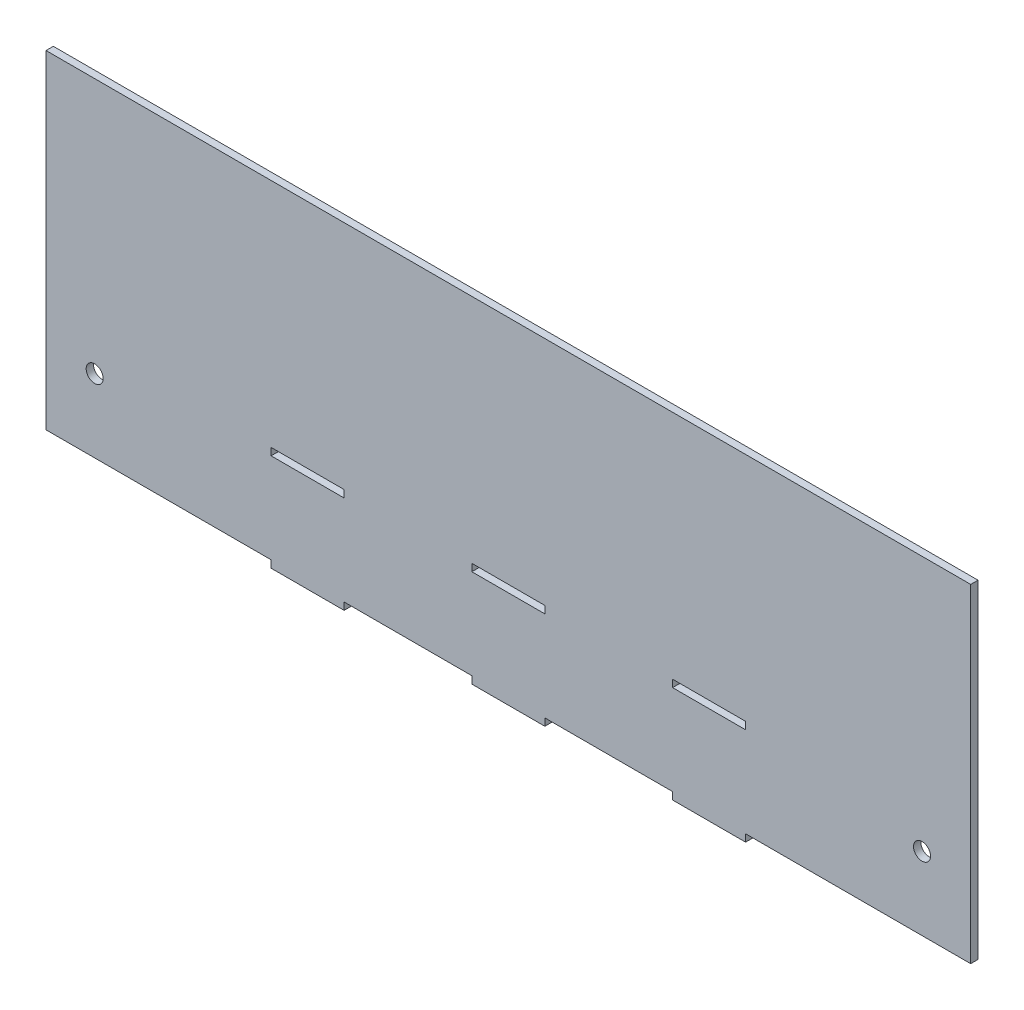
ISO-10303-21;
HEADER;
FILE_DESCRIPTION(('STEP AP214'),'2;1');
FILE_NAME('part.step','',(''),(''),'','','');
FILE_SCHEMA(('AUTOMOTIVE_DESIGN { 1 0 10303 214 1 1 1 1 }'));
ENDSEC;
DATA;
#1=APPLICATION_CONTEXT('core data for automotive mechanical design processes');
#2=APPLICATION_PROTOCOL_DEFINITION('international standard','automotive_design',2000,#1);
#3=PRODUCT_CONTEXT('',#1,'mechanical');
#4=PRODUCT('Part','Part','',(#3));
#5=PRODUCT_RELATED_PRODUCT_CATEGORY('part','',(#4));
#6=PRODUCT_DEFINITION_FORMATION('','',#4);
#7=PRODUCT_DEFINITION_CONTEXT('part definition',#1,'design');
#8=PRODUCT_DEFINITION('design','',#6,#7);
#9=PRODUCT_DEFINITION_SHAPE('','',#8);
#10=(LENGTH_UNIT() NAMED_UNIT(*) SI_UNIT(.MILLI.,.METRE.));
#11=(NAMED_UNIT(*) PLANE_ANGLE_UNIT() SI_UNIT($,.RADIAN.));
#12=(NAMED_UNIT(*) SI_UNIT($,.STERADIAN.) SOLID_ANGLE_UNIT());
#13=UNCERTAINTY_MEASURE_WITH_UNIT(LENGTH_MEASURE(1.E-05),#10,'distance_accuracy_value','');
#14=(GEOMETRIC_REPRESENTATION_CONTEXT(3) GLOBAL_UNCERTAINTY_ASSIGNED_CONTEXT((#13)) GLOBAL_UNIT_ASSIGNED_CONTEXT((#10,
#11,#12)) REPRESENTATION_CONTEXT('',''));
#15=CARTESIAN_POINT('',(0.,0.,0.));
#16=DIRECTION('',(0.,0.,1.));
#17=DIRECTION('',(1.,0.,0.));
#18=AXIS2_PLACEMENT_3D('',#15,#16,#17);
#19=CARTESIAN_POINT('',(0.,0.,3.));
#20=DIRECTION('',(0.,0.,-1.));
#21=DIRECTION('',(-1.,0.,0.));
#22=AXIS2_PLACEMENT_3D('',#19,#20,#21);
#23=PLANE('',#22);
#24=DIRECTION('',(0.,1.,0.));
#25=VECTOR('',#24,1.);
#26=CARTESIAN_POINT('',(97.5,-30.5,3.));
#27=LINE('',#26,#25);
#28=CARTESIAN_POINT('',(97.5,-30.5,3.));
#29=VERTEX_POINT('',#28);
#30=CARTESIAN_POINT('',(97.5,-27.5,3.));
#31=VERTEX_POINT('',#30);
#32=EDGE_CURVE('E278',#29,#31,#27,.T.);
#33=ORIENTED_EDGE('',*,*,#32,.F.);
#34=DIRECTION('',(1.,0.,0.));
#35=VECTOR('',#34,1.);
#36=CARTESIAN_POINT('',(67.5,-30.5,3.));
#37=LINE('',#36,#35);
#38=CARTESIAN_POINT('',(67.5,-30.5,3.));
#39=VERTEX_POINT('',#38);
#40=EDGE_CURVE('E289',#39,#29,#37,.T.);
#41=ORIENTED_EDGE('',*,*,#40,.F.);
#42=DIRECTION('',(0.,-1.,0.));
#43=VECTOR('',#42,1.);
#44=CARTESIAN_POINT('',(67.5,-30.5,3.));
#45=LINE('',#44,#43);
#46=CARTESIAN_POINT('',(67.5,-27.5,3.));
#47=VERTEX_POINT('',#46);
#48=EDGE_CURVE('E285',#47,#39,#45,.T.);
#49=ORIENTED_EDGE('',*,*,#48,.F.);
#50=DIRECTION('',(-1.,0.,0.));
#51=VECTOR('',#50,1.);
#52=CARTESIAN_POINT('',(67.5,-27.5,3.));
#53=LINE('',#52,#51);
#54=EDGE_CURVE('E281',#31,#47,#53,.T.);
#55=ORIENTED_EDGE('',*,*,#54,.F.);
#56=EDGE_LOOP('',(#33,#41,#49,#55));
#57=FACE_BOUND('',#56,.T.);
#58=DIRECTION('',(0.,1.,0.));
#59=VECTOR('',#58,1.);
#60=CARTESIAN_POINT('',(190.,-67.5,3.));
#61=LINE('',#60,#59);
#62=CARTESIAN_POINT('',(190.,-67.5,3.));
#63=VERTEX_POINT('',#62);
#64=CARTESIAN_POINT('',(190.,67.5,3.));
#65=VERTEX_POINT('',#64);
#66=EDGE_CURVE('E364',#63,#65,#61,.T.);
#67=ORIENTED_EDGE('',*,*,#66,.T.);
#68=DIRECTION('',(-1.,0.,0.));
#69=VECTOR('',#68,1.);
#70=CARTESIAN_POINT('',(-190.,67.5,3.));
#71=LINE('',#70,#69);
#72=CARTESIAN_POINT('',(-190.,67.5,3.));
#73=VERTEX_POINT('',#72);
#74=EDGE_CURVE('E368',#65,#73,#71,.T.);
#75=ORIENTED_EDGE('',*,*,#74,.T.);
#76=DIRECTION('',(0.,-1.,0.));
#77=VECTOR('',#76,1.);
#78=CARTESIAN_POINT('',(-190.,-67.5,3.));
#79=LINE('',#78,#77);
#80=CARTESIAN_POINT('',(-190.,-67.5,3.));
#81=VERTEX_POINT('',#80);
#82=EDGE_CURVE('E372',#73,#81,#79,.T.);
#83=ORIENTED_EDGE('',*,*,#82,.T.);
#84=DIRECTION('',(1.,0.,0.));
#85=VECTOR('',#84,1.);
#86=CARTESIAN_POINT('',(-190.,-67.5,3.));
#87=LINE('',#86,#85);
#88=CARTESIAN_POINT('',(-97.5,-67.5,3.));
#89=VERTEX_POINT('',#88);
#90=EDGE_CURVE('E375',#81,#89,#87,.T.);
#91=ORIENTED_EDGE('',*,*,#90,.T.);
#92=DIRECTION('',(0.,-1.,0.));
#93=VECTOR('',#92,1.);
#94=CARTESIAN_POINT('',(-97.5,-70.5,3.));
#95=LINE('',#94,#93);
#96=CARTESIAN_POINT('',(-97.5,-70.5,3.));
#97=VERTEX_POINT('',#96);
#98=EDGE_CURVE('E378',#89,#97,#95,.T.);
#99=ORIENTED_EDGE('',*,*,#98,.T.);
#100=DIRECTION('',(1.,0.,0.));
#101=VECTOR('',#100,1.);
#102=CARTESIAN_POINT('',(-97.5,-70.5,3.));
#103=LINE('',#102,#101);
#104=CARTESIAN_POINT('',(-67.5,-70.5,3.));
#105=VERTEX_POINT('',#104);
#106=EDGE_CURVE('E381',#97,#105,#103,.T.);
#107=ORIENTED_EDGE('',*,*,#106,.T.);
#108=DIRECTION('',(0.,1.,0.));
#109=VECTOR('',#108,1.);
#110=CARTESIAN_POINT('',(-67.5,-70.5,3.));
#111=LINE('',#110,#109);
#112=CARTESIAN_POINT('',(-67.5,-67.5,3.));
#113=VERTEX_POINT('',#112);
#114=EDGE_CURVE('E384',#105,#113,#111,.T.);
#115=ORIENTED_EDGE('',*,*,#114,.T.);
#116=DIRECTION('',(1.,0.,0.));
#117=VECTOR('',#116,1.);
#118=CARTESIAN_POINT('',(-67.5,-67.5,3.));
#119=LINE('',#118,#117);
#120=CARTESIAN_POINT('',(-14.9999999999999,-67.5,3.));
#121=VERTEX_POINT('',#120);
#122=EDGE_CURVE('E387',#113,#121,#119,.T.);
#123=ORIENTED_EDGE('',*,*,#122,.T.);
#124=DIRECTION('',(0.,-1.,0.));
#125=VECTOR('',#124,1.);
#126=CARTESIAN_POINT('',(-14.9999999999999,-70.5,3.));
#127=LINE('',#126,#125);
#128=CARTESIAN_POINT('',(-14.9999999999999,-70.5,3.));
#129=VERTEX_POINT('',#128);
#130=EDGE_CURVE('E390',#121,#129,#127,.T.);
#131=ORIENTED_EDGE('',*,*,#130,.T.);
#132=DIRECTION('',(1.,0.,0.));
#133=VECTOR('',#132,1.);
#134=CARTESIAN_POINT('',(-14.9999999999999,-70.5,3.));
#135=LINE('',#134,#133);
#136=CARTESIAN_POINT('',(15.0000000000001,-70.5,3.));
#137=VERTEX_POINT('',#136);
#138=EDGE_CURVE('E393',#129,#137,#135,.T.);
#139=ORIENTED_EDGE('',*,*,#138,.T.);
#140=DIRECTION('',(0.,1.,0.));
#141=VECTOR('',#140,1.);
#142=CARTESIAN_POINT('',(15.0000000000001,-70.5,3.));
#143=LINE('',#142,#141);
#144=CARTESIAN_POINT('',(15.0000000000001,-67.5,3.));
#145=VERTEX_POINT('',#144);
#146=EDGE_CURVE('E396',#137,#145,#143,.T.);
#147=ORIENTED_EDGE('',*,*,#146,.T.);
#148=DIRECTION('',(1.,0.,0.));
#149=VECTOR('',#148,1.);
#150=CARTESIAN_POINT('',(15.0000000000001,-67.5,3.));
#151=LINE('',#150,#149);
#152=CARTESIAN_POINT('',(67.5,-67.5,3.));
#153=VERTEX_POINT('',#152);
#154=EDGE_CURVE('E399',#145,#153,#151,.T.);
#155=ORIENTED_EDGE('',*,*,#154,.T.);
#156=DIRECTION('',(0.,-1.,0.));
#157=VECTOR('',#156,1.);
#158=CARTESIAN_POINT('',(67.5,-70.5,3.));
#159=LINE('',#158,#157);
#160=CARTESIAN_POINT('',(67.5,-70.5,3.));
#161=VERTEX_POINT('',#160);
#162=EDGE_CURVE('E402',#153,#161,#159,.T.);
#163=ORIENTED_EDGE('',*,*,#162,.T.);
#164=DIRECTION('',(1.,0.,0.));
#165=VECTOR('',#164,1.);
#166=CARTESIAN_POINT('',(67.5,-70.5,3.));
#167=LINE('',#166,#165);
#168=CARTESIAN_POINT('',(97.5,-70.5,3.));
#169=VERTEX_POINT('',#168);
#170=EDGE_CURVE('E405',#161,#169,#167,.T.);
#171=ORIENTED_EDGE('',*,*,#170,.T.);
#172=DIRECTION('',(0.,1.,0.));
#173=VECTOR('',#172,1.);
#174=CARTESIAN_POINT('',(97.5,-70.5,3.));
#175=LINE('',#174,#173);
#176=CARTESIAN_POINT('',(97.5,-67.5,3.));
#177=VERTEX_POINT('',#176);
#178=EDGE_CURVE('E408',#169,#177,#175,.T.);
#179=ORIENTED_EDGE('',*,*,#178,.T.);
#180=DIRECTION('',(1.,0.,0.));
#181=VECTOR('',#180,1.);
#182=CARTESIAN_POINT('',(97.5,-67.5,3.));
#183=LINE('',#182,#181);
#184=EDGE_CURVE('E411',#177,#63,#183,.T.);
#185=ORIENTED_EDGE('',*,*,#184,.T.);
#186=EDGE_LOOP('',(#67,#75,#83,#91,#99,#107,#115,#123,#131,#139,#147,#155,#163,#171,#179,#185));
#187=FACE_BOUND('',#186,.T.);
#188=DIRECTION('',(0.,1.,0.));
#189=VECTOR('',#188,1.);
#190=CARTESIAN_POINT('',(15.,-30.5,3.));
#191=LINE('',#190,#189);
#192=CARTESIAN_POINT('',(15.,-30.5,3.));
#193=VERTEX_POINT('',#192);
#194=CARTESIAN_POINT('',(15.,-27.5,3.));
#195=VERTEX_POINT('',#194);
#196=EDGE_CURVE('E321',#193,#195,#191,.T.);
#197=ORIENTED_EDGE('',*,*,#196,.F.);
#198=DIRECTION('',(1.,0.,0.));
#199=VECTOR('',#198,1.);
#200=CARTESIAN_POINT('',(-15.,-30.5,3.));
#201=LINE('',#200,#199);
#202=CARTESIAN_POINT('',(-15.,-30.5,3.));
#203=VERTEX_POINT('',#202);
#204=EDGE_CURVE('E332',#203,#193,#201,.T.);
#205=ORIENTED_EDGE('',*,*,#204,.F.);
#206=DIRECTION('',(0.,-1.,0.));
#207=VECTOR('',#206,1.);
#208=CARTESIAN_POINT('',(-15.,-30.5,3.));
#209=LINE('',#208,#207);
#210=CARTESIAN_POINT('',(-15.,-27.5,3.));
#211=VERTEX_POINT('',#210);
#212=EDGE_CURVE('E328',#211,#203,#209,.T.);
#213=ORIENTED_EDGE('',*,*,#212,.F.);
#214=DIRECTION('',(-1.,0.,0.));
#215=VECTOR('',#214,1.);
#216=CARTESIAN_POINT('',(-15.,-27.5,3.));
#217=LINE('',#216,#215);
#218=EDGE_CURVE('E324',#195,#211,#217,.T.);
#219=ORIENTED_EDGE('',*,*,#218,.F.);
#220=EDGE_LOOP('',(#197,#205,#213,#219));
#221=FACE_BOUND('',#220,.T.);
#222=DIRECTION('',(0.,1.,0.));
#223=VECTOR('',#222,1.);
#224=CARTESIAN_POINT('',(-67.5,-30.5,3.));
#225=LINE('',#224,#223);
#226=CARTESIAN_POINT('',(-67.5,-30.5,3.));
#227=VERTEX_POINT('',#226);
#228=CARTESIAN_POINT('',(-67.5,-27.5,3.));
#229=VERTEX_POINT('',#228);
#230=EDGE_CURVE('E227',#227,#229,#225,.T.);
#231=ORIENTED_EDGE('',*,*,#230,.F.);
#232=DIRECTION('',(1.,0.,0.));
#233=VECTOR('',#232,1.);
#234=CARTESIAN_POINT('',(-97.5,-30.5,3.));
#235=LINE('',#234,#233);
#236=CARTESIAN_POINT('',(-97.5,-30.5,3.));
#237=VERTEX_POINT('',#236);
#238=EDGE_CURVE('E254',#237,#227,#235,.T.);
#239=ORIENTED_EDGE('',*,*,#238,.F.);
#240=DIRECTION('',(0.,-1.,0.));
#241=VECTOR('',#240,1.);
#242=CARTESIAN_POINT('',(-97.5,-30.5,3.));
#243=LINE('',#242,#241);
#244=CARTESIAN_POINT('',(-97.5,-27.5,3.));
#245=VERTEX_POINT('',#244);
#246=EDGE_CURVE('E250',#245,#237,#243,.T.);
#247=ORIENTED_EDGE('',*,*,#246,.F.);
#248=DIRECTION('',(-1.,0.,0.));
#249=VECTOR('',#248,1.);
#250=CARTESIAN_POINT('',(-97.5,-27.5,3.));
#251=LINE('',#250,#249);
#252=EDGE_CURVE('E236',#229,#245,#251,.T.);
#253=ORIENTED_EDGE('',*,*,#252,.F.);
#254=EDGE_LOOP('',(#231,#239,#247,#253));
#255=FACE_BOUND('',#254,.T.);
#256=CARTESIAN_POINT('',(-170.,-37.5,3.));
#257=DIRECTION('',(0.,0.,1.));
#258=DIRECTION('',(1.,0.,0.));
#259=AXIS2_PLACEMENT_3D('',#256,#257,#258);
#260=CIRCLE('',#259,3.49999999999999);
#261=CARTESIAN_POINT('',(-166.5,-37.5,3.));
#262=VERTEX_POINT('',#261);
#263=EDGE_CURVE('E262',#262,#262,#260,.T.);
#264=ORIENTED_EDGE('',*,*,#263,.F.);
#265=EDGE_LOOP('',(#264));
#266=FACE_BOUND('',#265,.T.);
#267=CARTESIAN_POINT('',(170.,-37.5,3.));
#268=DIRECTION('',(0.,0.,1.));
#269=DIRECTION('',(1.,0.,0.));
#270=AXIS2_PLACEMENT_3D('',#267,#268,#269);
#271=CIRCLE('',#270,3.49999999999999);
#272=CARTESIAN_POINT('',(173.5,-37.5,3.));
#273=VERTEX_POINT('',#272);
#274=EDGE_CURVE('E883',#273,#273,#271,.T.);
#275=ORIENTED_EDGE('',*,*,#274,.F.);
#276=EDGE_LOOP('',(#275));
#277=FACE_BOUND('',#276,.T.);
#278=ADVANCED_FACE('F41',(#57,#187,#221,#255,#266,#277),#23,.F.);
#279=CARTESIAN_POINT('',(0.,0.,0.));
#280=DIRECTION('',(0.,0.,-1.));
#281=DIRECTION('',(-1.,0.,0.));
#282=AXIS2_PLACEMENT_3D('',#279,#280,#281);
#283=PLANE('',#282);
#284=CARTESIAN_POINT('',(-170.,-37.5,0.));
#285=DIRECTION('',(0.,0.,1.));
#286=DIRECTION('',(1.,0.,0.));
#287=AXIS2_PLACEMENT_3D('',#284,#285,#286);
#288=CIRCLE('',#287,3.49999999999999);
#289=CARTESIAN_POINT('',(-166.5,-37.5,0.));
#290=VERTEX_POINT('',#289);
#291=EDGE_CURVE('E891',#290,#290,#288,.T.);
#292=ORIENTED_EDGE('',*,*,#291,.T.);
#293=EDGE_LOOP('',(#292));
#294=FACE_BOUND('',#293,.T.);
#295=DIRECTION('',(0.,1.,0.));
#296=VECTOR('',#295,1.);
#297=CARTESIAN_POINT('',(190.,-67.5,0.));
#298=LINE('',#297,#296);
#299=CARTESIAN_POINT('',(190.,-67.5,0.));
#300=VERTEX_POINT('',#299);
#301=CARTESIAN_POINT('',(190.,67.5,0.));
#302=VERTEX_POINT('',#301);
#303=EDGE_CURVE('E363',#300,#302,#298,.T.);
#304=ORIENTED_EDGE('',*,*,#303,.F.);
#305=DIRECTION('',(1.,0.,0.));
#306=VECTOR('',#305,1.);
#307=CARTESIAN_POINT('',(97.5,-67.5,0.));
#308=LINE('',#307,#306);
#309=CARTESIAN_POINT('',(97.5,-67.5,0.));
#310=VERTEX_POINT('',#309);
#311=EDGE_CURVE('E369',#310,#300,#308,.T.);
#312=ORIENTED_EDGE('',*,*,#311,.F.);
#313=DIRECTION('',(0.,1.,0.));
#314=VECTOR('',#313,1.);
#315=CARTESIAN_POINT('',(97.5,-70.5,0.));
#316=LINE('',#315,#314);
#317=CARTESIAN_POINT('',(97.5,-70.5,0.));
#318=VERTEX_POINT('',#317);
#319=EDGE_CURVE('E457',#318,#310,#316,.T.);
#320=ORIENTED_EDGE('',*,*,#319,.F.);
#321=DIRECTION('',(1.,0.,0.));
#322=VECTOR('',#321,1.);
#323=CARTESIAN_POINT('',(67.5,-70.5,0.));
#324=LINE('',#323,#322);
#325=CARTESIAN_POINT('',(67.5,-70.5,0.));
#326=VERTEX_POINT('',#325);
#327=EDGE_CURVE('E454',#326,#318,#324,.T.);
#328=ORIENTED_EDGE('',*,*,#327,.F.);
#329=DIRECTION('',(0.,-1.,0.));
#330=VECTOR('',#329,1.);
#331=CARTESIAN_POINT('',(67.5,-70.5,0.));
#332=LINE('',#331,#330);
#333=CARTESIAN_POINT('',(67.5,-67.5,0.));
#334=VERTEX_POINT('',#333);
#335=EDGE_CURVE('E451',#334,#326,#332,.T.);
#336=ORIENTED_EDGE('',*,*,#335,.F.);
#337=DIRECTION('',(1.,0.,0.));
#338=VECTOR('',#337,1.);
#339=CARTESIAN_POINT('',(15.0000000000001,-67.5,0.));
#340=LINE('',#339,#338);
#341=CARTESIAN_POINT('',(15.0000000000001,-67.5,0.));
#342=VERTEX_POINT('',#341);
#343=EDGE_CURVE('E448',#342,#334,#340,.T.);
#344=ORIENTED_EDGE('',*,*,#343,.F.);
#345=DIRECTION('',(0.,1.,0.));
#346=VECTOR('',#345,1.);
#347=CARTESIAN_POINT('',(15.0000000000001,-70.5,0.));
#348=LINE('',#347,#346);
#349=CARTESIAN_POINT('',(15.0000000000001,-70.5,0.));
#350=VERTEX_POINT('',#349);
#351=EDGE_CURVE('E445',#350,#342,#348,.T.);
#352=ORIENTED_EDGE('',*,*,#351,.F.);
#353=DIRECTION('',(1.,0.,0.));
#354=VECTOR('',#353,1.);
#355=CARTESIAN_POINT('',(-14.9999999999999,-70.5,0.));
#356=LINE('',#355,#354);
#357=CARTESIAN_POINT('',(-14.9999999999999,-70.5,0.));
#358=VERTEX_POINT('',#357);
#359=EDGE_CURVE('E442',#358,#350,#356,.T.);
#360=ORIENTED_EDGE('',*,*,#359,.F.);
#361=DIRECTION('',(0.,-1.,0.));
#362=VECTOR('',#361,1.);
#363=CARTESIAN_POINT('',(-14.9999999999999,-70.5,0.));
#364=LINE('',#363,#362);
#365=CARTESIAN_POINT('',(-14.9999999999999,-67.5,0.));
#366=VERTEX_POINT('',#365);
#367=EDGE_CURVE('E439',#366,#358,#364,.T.);
#368=ORIENTED_EDGE('',*,*,#367,.F.);
#369=DIRECTION('',(1.,0.,0.));
#370=VECTOR('',#369,1.);
#371=CARTESIAN_POINT('',(-67.5,-67.5,0.));
#372=LINE('',#371,#370);
#373=CARTESIAN_POINT('',(-67.5,-67.5,0.));
#374=VERTEX_POINT('',#373);
#375=EDGE_CURVE('E436',#374,#366,#372,.T.);
#376=ORIENTED_EDGE('',*,*,#375,.F.);
#377=DIRECTION('',(0.,1.,0.));
#378=VECTOR('',#377,1.);
#379=CARTESIAN_POINT('',(-67.5,-70.5,0.));
#380=LINE('',#379,#378);
#381=CARTESIAN_POINT('',(-67.5,-70.5,0.));
#382=VERTEX_POINT('',#381);
#383=EDGE_CURVE('E433',#382,#374,#380,.T.);
#384=ORIENTED_EDGE('',*,*,#383,.F.);
#385=DIRECTION('',(1.,0.,0.));
#386=VECTOR('',#385,1.);
#387=CARTESIAN_POINT('',(-97.5,-70.5,0.));
#388=LINE('',#387,#386);
#389=CARTESIAN_POINT('',(-97.5,-70.5,0.));
#390=VERTEX_POINT('',#389);
#391=EDGE_CURVE('E430',#390,#382,#388,.T.);
#392=ORIENTED_EDGE('',*,*,#391,.F.);
#393=DIRECTION('',(0.,-1.,0.));
#394=VECTOR('',#393,1.);
#395=CARTESIAN_POINT('',(-97.5,-70.5,0.));
#396=LINE('',#395,#394);
#397=CARTESIAN_POINT('',(-97.5,-67.5,0.));
#398=VERTEX_POINT('',#397);
#399=EDGE_CURVE('E427',#398,#390,#396,.T.);
#400=ORIENTED_EDGE('',*,*,#399,.F.);
#401=DIRECTION('',(1.,0.,0.));
#402=VECTOR('',#401,1.);
#403=CARTESIAN_POINT('',(-190.,-67.5,0.));
#404=LINE('',#403,#402);
#405=CARTESIAN_POINT('',(-190.,-67.5,0.));
#406=VERTEX_POINT('',#405);
#407=EDGE_CURVE('E424',#406,#398,#404,.T.);
#408=ORIENTED_EDGE('',*,*,#407,.F.);
#409=DIRECTION('',(0.,-1.,0.));
#410=VECTOR('',#409,1.);
#411=CARTESIAN_POINT('',(-190.,-67.5,0.));
#412=LINE('',#411,#410);
#413=CARTESIAN_POINT('',(-190.,67.5,0.));
#414=VERTEX_POINT('',#413);
#415=EDGE_CURVE('E421',#414,#406,#412,.T.);
#416=ORIENTED_EDGE('',*,*,#415,.F.);
#417=DIRECTION('',(-1.,0.,0.));
#418=VECTOR('',#417,1.);
#419=CARTESIAN_POINT('',(-190.,67.5,0.));
#420=LINE('',#419,#418);
#421=EDGE_CURVE('E418',#302,#414,#420,.T.);
#422=ORIENTED_EDGE('',*,*,#421,.F.);
#423=EDGE_LOOP('',(#304,#312,#320,#328,#336,#344,#352,#360,#368,#376,#384,#392,#400,#408,#416,#422));
#424=FACE_BOUND('',#423,.T.);
#425=DIRECTION('',(1.,0.,0.));
#426=VECTOR('',#425,1.);
#427=CARTESIAN_POINT('',(-15.,-30.5,0.));
#428=LINE('',#427,#426);
#429=CARTESIAN_POINT('',(-15.,-30.5,0.));
#430=VERTEX_POINT('',#429);
#431=CARTESIAN_POINT('',(15.,-30.5,0.));
#432=VERTEX_POINT('',#431);
#433=EDGE_CURVE('E325',#430,#432,#428,.T.);
#434=ORIENTED_EDGE('',*,*,#433,.T.);
#435=DIRECTION('',(0.,1.,0.));
#436=VECTOR('',#435,1.);
#437=CARTESIAN_POINT('',(15.,-30.5,0.));
#438=LINE('',#437,#436);
#439=CARTESIAN_POINT('',(15.,-27.5,0.));
#440=VERTEX_POINT('',#439);
#441=EDGE_CURVE('E320',#432,#440,#438,.T.);
#442=ORIENTED_EDGE('',*,*,#441,.T.);
#443=DIRECTION('',(-1.,0.,0.));
#444=VECTOR('',#443,1.);
#445=CARTESIAN_POINT('',(-15.,-27.5,0.));
#446=LINE('',#445,#444);
#447=CARTESIAN_POINT('',(-15.,-27.5,0.));
#448=VERTEX_POINT('',#447);
#449=EDGE_CURVE('E339',#440,#448,#446,.T.);
#450=ORIENTED_EDGE('',*,*,#449,.T.);
#451=DIRECTION('',(0.,-1.,0.));
#452=VECTOR('',#451,1.);
#453=CARTESIAN_POINT('',(-15.,-30.5,0.));
#454=LINE('',#453,#452);
#455=EDGE_CURVE('E343',#448,#430,#454,.T.);
#456=ORIENTED_EDGE('',*,*,#455,.T.);
#457=EDGE_LOOP('',(#434,#442,#450,#456));
#458=FACE_BOUND('',#457,.T.);
#459=DIRECTION('',(1.,0.,0.));
#460=VECTOR('',#459,1.);
#461=CARTESIAN_POINT('',(67.5,-30.5,0.));
#462=LINE('',#461,#460);
#463=CARTESIAN_POINT('',(67.5,-30.5,0.));
#464=VERTEX_POINT('',#463);
#465=CARTESIAN_POINT('',(97.5,-30.5,0.));
#466=VERTEX_POINT('',#465);
#467=EDGE_CURVE('E282',#464,#466,#462,.T.);
#468=ORIENTED_EDGE('',*,*,#467,.T.);
#469=DIRECTION('',(0.,1.,0.));
#470=VECTOR('',#469,1.);
#471=CARTESIAN_POINT('',(97.5,-30.5,0.));
#472=LINE('',#471,#470);
#473=CARTESIAN_POINT('',(97.5,-27.5,0.));
#474=VERTEX_POINT('',#473);
#475=EDGE_CURVE('E245',#466,#474,#472,.T.);
#476=ORIENTED_EDGE('',*,*,#475,.T.);
#477=DIRECTION('',(-1.,0.,0.));
#478=VECTOR('',#477,1.);
#479=CARTESIAN_POINT('',(67.5,-27.5,0.));
#480=LINE('',#479,#478);
#481=CARTESIAN_POINT('',(67.5,-27.5,0.));
#482=VERTEX_POINT('',#481);
#483=EDGE_CURVE('E296',#474,#482,#480,.T.);
#484=ORIENTED_EDGE('',*,*,#483,.T.);
#485=DIRECTION('',(0.,-1.,0.));
#486=VECTOR('',#485,1.);
#487=CARTESIAN_POINT('',(67.5,-30.5,0.));
#488=LINE('',#487,#486);
#489=EDGE_CURVE('E300',#482,#464,#488,.T.);
#490=ORIENTED_EDGE('',*,*,#489,.T.);
#491=EDGE_LOOP('',(#468,#476,#484,#490));
#492=FACE_BOUND('',#491,.T.);
#493=DIRECTION('',(1.,0.,0.));
#494=VECTOR('',#493,1.);
#495=CARTESIAN_POINT('',(-97.5,-30.5,0.));
#496=LINE('',#495,#494);
#497=CARTESIAN_POINT('',(-97.5,-30.5,0.));
#498=VERTEX_POINT('',#497);
#499=CARTESIAN_POINT('',(-67.5,-30.5,0.));
#500=VERTEX_POINT('',#499);
#501=EDGE_CURVE('E237',#498,#500,#496,.T.);
#502=ORIENTED_EDGE('',*,*,#501,.T.);
#503=DIRECTION('',(0.,1.,0.));
#504=VECTOR('',#503,1.);
#505=CARTESIAN_POINT('',(-67.5,-30.5,0.));
#506=LINE('',#505,#504);
#507=CARTESIAN_POINT('',(-67.5,-27.5,0.));
#508=VERTEX_POINT('',#507);
#509=EDGE_CURVE('E65',#500,#508,#506,.T.);
#510=ORIENTED_EDGE('',*,*,#509,.T.);
#511=DIRECTION('',(-1.,0.,0.));
#512=VECTOR('',#511,1.);
#513=CARTESIAN_POINT('',(-97.5,-27.5,0.));
#514=LINE('',#513,#512);
#515=CARTESIAN_POINT('',(-97.5,-27.5,0.));
#516=VERTEX_POINT('',#515);
#517=EDGE_CURVE('E243',#508,#516,#514,.T.);
#518=ORIENTED_EDGE('',*,*,#517,.T.);
#519=DIRECTION('',(0.,-1.,0.));
#520=VECTOR('',#519,1.);
#521=CARTESIAN_POINT('',(-97.5,-30.5,0.));
#522=LINE('',#521,#520);
#523=EDGE_CURVE('E265',#516,#498,#522,.T.);
#524=ORIENTED_EDGE('',*,*,#523,.T.);
#525=EDGE_LOOP('',(#502,#510,#518,#524));
#526=FACE_BOUND('',#525,.T.);
#527=CARTESIAN_POINT('',(170.,-37.5,0.));
#528=DIRECTION('',(0.,0.,1.));
#529=DIRECTION('',(1.,0.,0.));
#530=AXIS2_PLACEMENT_3D('',#527,#528,#529);
#531=CIRCLE('',#530,3.49999999999999);
#532=CARTESIAN_POINT('',(173.5,-37.5,0.));
#533=VERTEX_POINT('',#532);
#534=EDGE_CURVE('E886',#533,#533,#531,.T.);
#535=ORIENTED_EDGE('',*,*,#534,.T.);
#536=EDGE_LOOP('',(#535));
#537=FACE_BOUND('',#536,.T.);
#538=ADVANCED_FACE('F528',(#294,#424,#458,#492,#526,#537),#283,.T.);
#539=CARTESIAN_POINT('',(190.,-67.5,3.));
#540=DIRECTION('',(-1.,0.,0.));
#541=DIRECTION('',(0.,0.,1.));
#542=AXIS2_PLACEMENT_3D('',#539,#540,#541);
#543=PLANE('',#542);
#544=ORIENTED_EDGE('',*,*,#303,.T.);
#545=DIRECTION('',(0.,0.,-1.));
#546=VECTOR('',#545,1.);
#547=CARTESIAN_POINT('',(190.,67.5,3.));
#548=LINE('',#547,#546);
#549=EDGE_CURVE('E11',#65,#302,#548,.T.);
#550=ORIENTED_EDGE('',*,*,#549,.F.);
#551=ORIENTED_EDGE('',*,*,#66,.F.);
#552=DIRECTION('',(0.,0.,-1.));
#553=VECTOR('',#552,1.);
#554=CARTESIAN_POINT('',(190.,-67.5,3.));
#555=LINE('',#554,#553);
#556=EDGE_CURVE('E414',#63,#300,#555,.T.);
#557=ORIENTED_EDGE('',*,*,#556,.T.);
#558=EDGE_LOOP('',(#544,#550,#551,#557));
#559=FACE_BOUND('',#558,.T.);
#560=ADVANCED_FACE('F43',(#559),#543,.F.);
#561=CARTESIAN_POINT('',(-190.,67.5,3.));
#562=DIRECTION('',(0.,-1.,0.));
#563=DIRECTION('',(1.,0.,0.));
#564=AXIS2_PLACEMENT_3D('',#561,#562,#563);
#565=PLANE('',#564);
#566=ORIENTED_EDGE('',*,*,#421,.T.);
#567=DIRECTION('',(0.,0.,-1.));
#568=VECTOR('',#567,1.);
#569=CARTESIAN_POINT('',(-190.,67.5,3.));
#570=LINE('',#569,#568);
#571=EDGE_CURVE('E50',#73,#414,#570,.T.);
#572=ORIENTED_EDGE('',*,*,#571,.F.);
#573=ORIENTED_EDGE('',*,*,#74,.F.);
#574=ORIENTED_EDGE('',*,*,#549,.T.);
#575=EDGE_LOOP('',(#566,#572,#573,#574));
#576=FACE_BOUND('',#575,.T.);
#577=ADVANCED_FACE('F546',(#576),#565,.F.);
#578=CARTESIAN_POINT('',(-190.,-67.5,3.));
#579=DIRECTION('',(1.,0.,0.));
#580=DIRECTION('',(0.,0.,-1.));
#581=AXIS2_PLACEMENT_3D('',#578,#579,#580);
#582=PLANE('',#581);
#583=ORIENTED_EDGE('',*,*,#415,.T.);
#584=DIRECTION('',(0.,0.,-1.));
#585=VECTOR('',#584,1.);
#586=CARTESIAN_POINT('',(-190.,-67.5,3.));
#587=LINE('',#586,#585);
#588=EDGE_CURVE('E513',#81,#406,#587,.T.);
#589=ORIENTED_EDGE('',*,*,#588,.F.);
#590=ORIENTED_EDGE('',*,*,#82,.F.);
#591=ORIENTED_EDGE('',*,*,#571,.T.);
#592=EDGE_LOOP('',(#583,#589,#590,#591));
#593=FACE_BOUND('',#592,.T.);
#594=ADVANCED_FACE('F522',(#593),#582,.F.);
#595=CARTESIAN_POINT('',(-190.,-67.5,3.));
#596=DIRECTION('',(0.,1.,0.));
#597=DIRECTION('',(0.,0.,1.));
#598=AXIS2_PLACEMENT_3D('',#595,#596,#597);
#599=PLANE('',#598);
#600=ORIENTED_EDGE('',*,*,#407,.T.);
#601=DIRECTION('',(0.,0.,-1.));
#602=VECTOR('',#601,1.);
#603=CARTESIAN_POINT('',(-97.5,-67.5,3.));
#604=LINE('',#603,#602);
#605=EDGE_CURVE('E509',#89,#398,#604,.T.);
#606=ORIENTED_EDGE('',*,*,#605,.F.);
#607=ORIENTED_EDGE('',*,*,#90,.F.);
#608=ORIENTED_EDGE('',*,*,#588,.T.);
#609=EDGE_LOOP('',(#600,#606,#607,#608));
#610=FACE_BOUND('',#609,.T.);
#611=ADVANCED_FACE('F534',(#610),#599,.F.);
#612=CARTESIAN_POINT('',(-97.5,-70.5,3.));
#613=DIRECTION('',(1.,0.,0.));
#614=DIRECTION('',(0.,0.,-1.));
#615=AXIS2_PLACEMENT_3D('',#612,#613,#614);
#616=PLANE('',#615);
#617=ORIENTED_EDGE('',*,*,#399,.T.);
#618=DIRECTION('',(0.,0.,-1.));
#619=VECTOR('',#618,1.);
#620=CARTESIAN_POINT('',(-97.5,-70.5,3.));
#621=LINE('',#620,#619);
#622=EDGE_CURVE('E505',#97,#390,#621,.T.);
#623=ORIENTED_EDGE('',*,*,#622,.F.);
#624=ORIENTED_EDGE('',*,*,#98,.F.);
#625=ORIENTED_EDGE('',*,*,#605,.T.);
#626=EDGE_LOOP('',(#617,#623,#624,#625));
#627=FACE_BOUND('',#626,.T.);
#628=ADVANCED_FACE('F538',(#627),#616,.F.);
#629=CARTESIAN_POINT('',(-97.5,-70.5,3.));
#630=DIRECTION('',(0.,1.,0.));
#631=DIRECTION('',(0.,0.,1.));
#632=AXIS2_PLACEMENT_3D('',#629,#630,#631);
#633=PLANE('',#632);
#634=ORIENTED_EDGE('',*,*,#391,.T.);
#635=DIRECTION('',(0.,0.,-1.));
#636=VECTOR('',#635,1.);
#637=CARTESIAN_POINT('',(-67.5,-70.5,3.));
#638=LINE('',#637,#636);
#639=EDGE_CURVE('E501',#105,#382,#638,.T.);
#640=ORIENTED_EDGE('',*,*,#639,.F.);
#641=ORIENTED_EDGE('',*,*,#106,.F.);
#642=ORIENTED_EDGE('',*,*,#622,.T.);
#643=EDGE_LOOP('',(#634,#640,#641,#642));
#644=FACE_BOUND('',#643,.T.);
#645=ADVANCED_FACE('F599',(#644),#633,.F.);
#646=CARTESIAN_POINT('',(-67.5,-70.5,3.));
#647=DIRECTION('',(-1.,0.,0.));
#648=DIRECTION('',(0.,0.,1.));
#649=AXIS2_PLACEMENT_3D('',#646,#647,#648);
#650=PLANE('',#649);
#651=ORIENTED_EDGE('',*,*,#383,.T.);
#652=DIRECTION('',(0.,0.,-1.));
#653=VECTOR('',#652,1.);
#654=CARTESIAN_POINT('',(-67.5,-67.5,3.));
#655=LINE('',#654,#653);
#656=EDGE_CURVE('E497',#113,#374,#655,.T.);
#657=ORIENTED_EDGE('',*,*,#656,.F.);
#658=ORIENTED_EDGE('',*,*,#114,.F.);
#659=ORIENTED_EDGE('',*,*,#639,.T.);
#660=EDGE_LOOP('',(#651,#657,#658,#659));
#661=FACE_BOUND('',#660,.T.);
#662=ADVANCED_FACE('F596',(#661),#650,.F.);
#663=CARTESIAN_POINT('',(-67.5,-67.5,3.));
#664=DIRECTION('',(0.,1.,0.));
#665=DIRECTION('',(0.,0.,1.));
#666=AXIS2_PLACEMENT_3D('',#663,#664,#665);
#667=PLANE('',#666);
#668=ORIENTED_EDGE('',*,*,#375,.T.);
#669=DIRECTION('',(0.,0.,-1.));
#670=VECTOR('',#669,1.);
#671=CARTESIAN_POINT('',(-14.9999999999999,-67.5,3.));
#672=LINE('',#671,#670);
#673=EDGE_CURVE('E493',#121,#366,#672,.T.);
#674=ORIENTED_EDGE('',*,*,#673,.F.);
#675=ORIENTED_EDGE('',*,*,#122,.F.);
#676=ORIENTED_EDGE('',*,*,#656,.T.);
#677=EDGE_LOOP('',(#668,#674,#675,#676));
#678=FACE_BOUND('',#677,.T.);
#679=ADVANCED_FACE('F592',(#678),#667,.F.);
#680=CARTESIAN_POINT('',(-14.9999999999999,-70.5,3.));
#681=DIRECTION('',(1.,0.,0.));
#682=DIRECTION('',(0.,0.,-1.));
#683=AXIS2_PLACEMENT_3D('',#680,#681,#682);
#684=PLANE('',#683);
#685=ORIENTED_EDGE('',*,*,#367,.T.);
#686=DIRECTION('',(0.,0.,-1.));
#687=VECTOR('',#686,1.);
#688=CARTESIAN_POINT('',(-14.9999999999999,-70.5,3.));
#689=LINE('',#688,#687);
#690=EDGE_CURVE('E489',#129,#358,#689,.T.);
#691=ORIENTED_EDGE('',*,*,#690,.F.);
#692=ORIENTED_EDGE('',*,*,#130,.F.);
#693=ORIENTED_EDGE('',*,*,#673,.T.);
#694=EDGE_LOOP('',(#685,#691,#692,#693));
#695=FACE_BOUND('',#694,.T.);
#696=ADVANCED_FACE('F588',(#695),#684,.F.);
#697=CARTESIAN_POINT('',(-14.9999999999999,-70.5,3.));
#698=DIRECTION('',(0.,1.,0.));
#699=DIRECTION('',(0.,0.,1.));
#700=AXIS2_PLACEMENT_3D('',#697,#698,#699);
#701=PLANE('',#700);
#702=ORIENTED_EDGE('',*,*,#359,.T.);
#703=DIRECTION('',(0.,0.,-1.));
#704=VECTOR('',#703,1.);
#705=CARTESIAN_POINT('',(15.0000000000001,-70.5,3.));
#706=LINE('',#705,#704);
#707=EDGE_CURVE('E485',#137,#350,#706,.T.);
#708=ORIENTED_EDGE('',*,*,#707,.F.);
#709=ORIENTED_EDGE('',*,*,#138,.F.);
#710=ORIENTED_EDGE('',*,*,#690,.T.);
#711=EDGE_LOOP('',(#702,#708,#709,#710));
#712=FACE_BOUND('',#711,.T.);
#713=ADVANCED_FACE('F583',(#712),#701,.F.);
#714=CARTESIAN_POINT('',(15.0000000000001,-70.5,3.));
#715=DIRECTION('',(-1.,0.,0.));
#716=DIRECTION('',(0.,0.,1.));
#717=AXIS2_PLACEMENT_3D('',#714,#715,#716);
#718=PLANE('',#717);
#719=ORIENTED_EDGE('',*,*,#351,.T.);
#720=DIRECTION('',(0.,0.,-1.));
#721=VECTOR('',#720,1.);
#722=CARTESIAN_POINT('',(15.0000000000001,-67.5,3.));
#723=LINE('',#722,#721);
#724=EDGE_CURVE('E481',#145,#342,#723,.T.);
#725=ORIENTED_EDGE('',*,*,#724,.F.);
#726=ORIENTED_EDGE('',*,*,#146,.F.);
#727=ORIENTED_EDGE('',*,*,#707,.T.);
#728=EDGE_LOOP('',(#719,#725,#726,#727));
#729=FACE_BOUND('',#728,.T.);
#730=ADVANCED_FACE('F577',(#729),#718,.F.);
#731=CARTESIAN_POINT('',(15.0000000000001,-67.5,3.));
#732=DIRECTION('',(0.,1.,0.));
#733=DIRECTION('',(0.,0.,1.));
#734=AXIS2_PLACEMENT_3D('',#731,#732,#733);
#735=PLANE('',#734);
#736=ORIENTED_EDGE('',*,*,#343,.T.);
#737=DIRECTION('',(0.,0.,-1.));
#738=VECTOR('',#737,1.);
#739=CARTESIAN_POINT('',(67.5,-67.5,3.));
#740=LINE('',#739,#738);
#741=EDGE_CURVE('E477',#153,#334,#740,.T.);
#742=ORIENTED_EDGE('',*,*,#741,.F.);
#743=ORIENTED_EDGE('',*,*,#154,.F.);
#744=ORIENTED_EDGE('',*,*,#724,.T.);
#745=EDGE_LOOP('',(#736,#742,#743,#744));
#746=FACE_BOUND('',#745,.T.);
#747=ADVANCED_FACE('F573',(#746),#735,.F.);
#748=CARTESIAN_POINT('',(67.5,-70.5,3.));
#749=DIRECTION('',(1.,0.,0.));
#750=DIRECTION('',(0.,0.,-1.));
#751=AXIS2_PLACEMENT_3D('',#748,#749,#750);
#752=PLANE('',#751);
#753=ORIENTED_EDGE('',*,*,#335,.T.);
#754=DIRECTION('',(0.,0.,-1.));
#755=VECTOR('',#754,1.);
#756=CARTESIAN_POINT('',(67.5,-70.5,3.));
#757=LINE('',#756,#755);
#758=EDGE_CURVE('E473',#161,#326,#757,.T.);
#759=ORIENTED_EDGE('',*,*,#758,.F.);
#760=ORIENTED_EDGE('',*,*,#162,.F.);
#761=ORIENTED_EDGE('',*,*,#741,.T.);
#762=EDGE_LOOP('',(#753,#759,#760,#761));
#763=FACE_BOUND('',#762,.T.);
#764=ADVANCED_FACE('F568',(#763),#752,.F.);
#765=CARTESIAN_POINT('',(67.5,-70.5,3.));
#766=DIRECTION('',(0.,1.,0.));
#767=DIRECTION('',(0.,0.,1.));
#768=AXIS2_PLACEMENT_3D('',#765,#766,#767);
#769=PLANE('',#768);
#770=ORIENTED_EDGE('',*,*,#327,.T.);
#771=DIRECTION('',(0.,0.,-1.));
#772=VECTOR('',#771,1.);
#773=CARTESIAN_POINT('',(97.5,-70.5,3.));
#774=LINE('',#773,#772);
#775=EDGE_CURVE('E469',#169,#318,#774,.T.);
#776=ORIENTED_EDGE('',*,*,#775,.F.);
#777=ORIENTED_EDGE('',*,*,#170,.F.);
#778=ORIENTED_EDGE('',*,*,#758,.T.);
#779=EDGE_LOOP('',(#770,#776,#777,#778));
#780=FACE_BOUND('',#779,.T.);
#781=ADVANCED_FACE('F562',(#780),#769,.F.);
#782=CARTESIAN_POINT('',(97.5,-70.5,3.));
#783=DIRECTION('',(-1.,0.,0.));
#784=DIRECTION('',(0.,0.,1.));
#785=AXIS2_PLACEMENT_3D('',#782,#783,#784);
#786=PLANE('',#785);
#787=ORIENTED_EDGE('',*,*,#319,.T.);
#788=DIRECTION('',(0.,0.,-1.));
#789=VECTOR('',#788,1.);
#790=CARTESIAN_POINT('',(97.5,-67.5,3.));
#791=LINE('',#790,#789);
#792=EDGE_CURVE('E465',#177,#310,#791,.T.);
#793=ORIENTED_EDGE('',*,*,#792,.F.);
#794=ORIENTED_EDGE('',*,*,#178,.F.);
#795=ORIENTED_EDGE('',*,*,#775,.T.);
#796=EDGE_LOOP('',(#787,#793,#794,#795));
#797=FACE_BOUND('',#796,.T.);
#798=ADVANCED_FACE('F558',(#797),#786,.F.);
#799=CARTESIAN_POINT('',(97.5,-67.5,3.));
#800=DIRECTION('',(0.,1.,0.));
#801=DIRECTION('',(-1.,0.,0.));
#802=AXIS2_PLACEMENT_3D('',#799,#800,#801);
#803=PLANE('',#802);
#804=ORIENTED_EDGE('',*,*,#311,.T.);
#805=ORIENTED_EDGE('',*,*,#556,.F.);
#806=ORIENTED_EDGE('',*,*,#184,.F.);
#807=ORIENTED_EDGE('',*,*,#792,.T.);
#808=EDGE_LOOP('',(#804,#805,#806,#807));
#809=FACE_BOUND('',#808,.T.);
#810=ADVANCED_FACE('F553',(#809),#803,.F.);
#811=CARTESIAN_POINT('',(15.,-30.5,3.));
#812=DIRECTION('',(-1.,0.,0.));
#813=DIRECTION('',(0.,0.,1.));
#814=AXIS2_PLACEMENT_3D('',#811,#812,#813);
#815=PLANE('',#814);
#816=ORIENTED_EDGE('',*,*,#441,.F.);
#817=DIRECTION('',(0.,0.,-1.));
#818=VECTOR('',#817,1.);
#819=CARTESIAN_POINT('',(15.,-30.5,3.));
#820=LINE('',#819,#818);
#821=EDGE_CURVE('E335',#193,#432,#820,.T.);
#822=ORIENTED_EDGE('',*,*,#821,.F.);
#823=ORIENTED_EDGE('',*,*,#196,.T.);
#824=DIRECTION('',(0.,0.,-1.));
#825=VECTOR('',#824,1.);
#826=CARTESIAN_POINT('',(15.,-27.5,3.));
#827=LINE('',#826,#825);
#828=EDGE_CURVE('E359',#195,#440,#827,.T.);
#829=ORIENTED_EDGE('',*,*,#828,.T.);
#830=EDGE_LOOP('',(#816,#822,#823,#829));
#831=FACE_BOUND('',#830,.T.);
#832=ADVANCED_FACE('F618',(#831),#815,.T.);
#833=CARTESIAN_POINT('',(-15.,-27.5,3.));
#834=DIRECTION('',(0.,-1.,0.));
#835=DIRECTION('',(0.,0.,-1.));
#836=AXIS2_PLACEMENT_3D('',#833,#834,#835);
#837=PLANE('',#836);
#838=ORIENTED_EDGE('',*,*,#449,.F.);
#839=ORIENTED_EDGE('',*,*,#828,.F.);
#840=ORIENTED_EDGE('',*,*,#218,.T.);
#841=DIRECTION('',(0.,0.,-1.));
#842=VECTOR('',#841,1.);
#843=CARTESIAN_POINT('',(-15.,-27.5,3.));
#844=LINE('',#843,#842);
#845=EDGE_CURVE('E356',#211,#448,#844,.T.);
#846=ORIENTED_EDGE('',*,*,#845,.T.);
#847=EDGE_LOOP('',(#838,#839,#840,#846));
#848=FACE_BOUND('',#847,.T.);
#849=ADVANCED_FACE('F680',(#848),#837,.T.);
#850=CARTESIAN_POINT('',(-15.,-30.5,3.));
#851=DIRECTION('',(1.,0.,0.));
#852=DIRECTION('',(0.,0.,-1.));
#853=AXIS2_PLACEMENT_3D('',#850,#851,#852);
#854=PLANE('',#853);
#855=ORIENTED_EDGE('',*,*,#455,.F.);
#856=ORIENTED_EDGE('',*,*,#845,.F.);
#857=ORIENTED_EDGE('',*,*,#212,.T.);
#858=DIRECTION('',(0.,0.,-1.));
#859=VECTOR('',#858,1.);
#860=CARTESIAN_POINT('',(-15.,-30.5,3.));
#861=LINE('',#860,#859);
#862=EDGE_CURVE('E353',#203,#430,#861,.T.);
#863=ORIENTED_EDGE('',*,*,#862,.T.);
#864=EDGE_LOOP('',(#855,#856,#857,#863));
#865=FACE_BOUND('',#864,.T.);
#866=ADVANCED_FACE('F687',(#865),#854,.T.);
#867=CARTESIAN_POINT('',(-15.,-30.5,3.));
#868=DIRECTION('',(0.,1.,0.));
#869=DIRECTION('',(0.,0.,1.));
#870=AXIS2_PLACEMENT_3D('',#867,#868,#869);
#871=PLANE('',#870);
#872=ORIENTED_EDGE('',*,*,#433,.F.);
#873=ORIENTED_EDGE('',*,*,#862,.F.);
#874=ORIENTED_EDGE('',*,*,#204,.T.);
#875=ORIENTED_EDGE('',*,*,#821,.T.);
#876=EDGE_LOOP('',(#872,#873,#874,#875));
#877=FACE_BOUND('',#876,.T.);
#878=ADVANCED_FACE('F694',(#877),#871,.T.);
#879=CARTESIAN_POINT('',(97.5,-30.5,3.));
#880=DIRECTION('',(-1.,0.,0.));
#881=DIRECTION('',(0.,0.,1.));
#882=AXIS2_PLACEMENT_3D('',#879,#880,#881);
#883=PLANE('',#882);
#884=ORIENTED_EDGE('',*,*,#475,.F.);
#885=DIRECTION('',(0.,0.,-1.));
#886=VECTOR('',#885,1.);
#887=CARTESIAN_POINT('',(97.5,-30.5,3.));
#888=LINE('',#887,#886);
#889=EDGE_CURVE('E292',#29,#466,#888,.T.);
#890=ORIENTED_EDGE('',*,*,#889,.F.);
#891=ORIENTED_EDGE('',*,*,#32,.T.);
#892=DIRECTION('',(0.,0.,-1.));
#893=VECTOR('',#892,1.);
#894=CARTESIAN_POINT('',(97.5,-27.5,3.));
#895=LINE('',#894,#893);
#896=EDGE_CURVE('E316',#31,#474,#895,.T.);
#897=ORIENTED_EDGE('',*,*,#896,.T.);
#898=EDGE_LOOP('',(#884,#890,#891,#897));
#899=FACE_BOUND('',#898,.T.);
#900=ADVANCED_FACE('F702',(#899),#883,.T.);
#901=CARTESIAN_POINT('',(67.5,-27.5,3.));
#902=DIRECTION('',(0.,-1.,0.));
#903=DIRECTION('',(0.,0.,-1.));
#904=AXIS2_PLACEMENT_3D('',#901,#902,#903);
#905=PLANE('',#904);
#906=ORIENTED_EDGE('',*,*,#483,.F.);
#907=ORIENTED_EDGE('',*,*,#896,.F.);
#908=ORIENTED_EDGE('',*,*,#54,.T.);
#909=DIRECTION('',(0.,0.,-1.));
#910=VECTOR('',#909,1.);
#911=CARTESIAN_POINT('',(67.5,-27.5,3.));
#912=LINE('',#911,#910);
#913=EDGE_CURVE('E313',#47,#482,#912,.T.);
#914=ORIENTED_EDGE('',*,*,#913,.T.);
#915=EDGE_LOOP('',(#906,#907,#908,#914));
#916=FACE_BOUND('',#915,.T.);
#917=ADVANCED_FACE('F710',(#916),#905,.T.);
#918=CARTESIAN_POINT('',(67.5,-30.5,3.));
#919=DIRECTION('',(1.,0.,0.));
#920=DIRECTION('',(0.,0.,-1.));
#921=AXIS2_PLACEMENT_3D('',#918,#919,#920);
#922=PLANE('',#921);
#923=ORIENTED_EDGE('',*,*,#489,.F.);
#924=ORIENTED_EDGE('',*,*,#913,.F.);
#925=ORIENTED_EDGE('',*,*,#48,.T.);
#926=DIRECTION('',(0.,0.,-1.));
#927=VECTOR('',#926,1.);
#928=CARTESIAN_POINT('',(67.5,-30.5,3.));
#929=LINE('',#928,#927);
#930=EDGE_CURVE('E310',#39,#464,#929,.T.);
#931=ORIENTED_EDGE('',*,*,#930,.T.);
#932=EDGE_LOOP('',(#923,#924,#925,#931));
#933=FACE_BOUND('',#932,.T.);
#934=ADVANCED_FACE('F718',(#933),#922,.T.);
#935=CARTESIAN_POINT('',(67.5,-30.5,3.));
#936=DIRECTION('',(0.,1.,0.));
#937=DIRECTION('',(0.,0.,1.));
#938=AXIS2_PLACEMENT_3D('',#935,#936,#937);
#939=PLANE('',#938);
#940=ORIENTED_EDGE('',*,*,#467,.F.);
#941=ORIENTED_EDGE('',*,*,#930,.F.);
#942=ORIENTED_EDGE('',*,*,#40,.T.);
#943=ORIENTED_EDGE('',*,*,#889,.T.);
#944=EDGE_LOOP('',(#940,#941,#942,#943));
#945=FACE_BOUND('',#944,.T.);
#946=ADVANCED_FACE('F726',(#945),#939,.T.);
#947=CARTESIAN_POINT('',(-67.5,-30.5,3.));
#948=DIRECTION('',(-1.,0.,0.));
#949=DIRECTION('',(0.,0.,1.));
#950=AXIS2_PLACEMENT_3D('',#947,#948,#949);
#951=PLANE('',#950);
#952=ORIENTED_EDGE('',*,*,#509,.F.);
#953=DIRECTION('',(0.,0.,-1.));
#954=VECTOR('',#953,1.);
#955=CARTESIAN_POINT('',(-67.5,-30.5,3.));
#956=LINE('',#955,#954);
#957=EDGE_CURVE('E231',#227,#500,#956,.T.);
#958=ORIENTED_EDGE('',*,*,#957,.F.);
#959=ORIENTED_EDGE('',*,*,#230,.T.);
#960=DIRECTION('',(0.,0.,-1.));
#961=VECTOR('',#960,1.);
#962=CARTESIAN_POINT('',(-67.5,-27.5,3.));
#963=LINE('',#962,#961);
#964=EDGE_CURVE('E230',#229,#508,#963,.T.);
#965=ORIENTED_EDGE('',*,*,#964,.T.);
#966=EDGE_LOOP('',(#952,#958,#959,#965));
#967=FACE_BOUND('',#966,.T.);
#968=ADVANCED_FACE('F229',(#967),#951,.T.);
#969=CARTESIAN_POINT('',(-97.5,-27.5,3.));
#970=DIRECTION('',(0.,-1.,0.));
#971=DIRECTION('',(0.,0.,-1.));
#972=AXIS2_PLACEMENT_3D('',#969,#970,#971);
#973=PLANE('',#972);
#974=ORIENTED_EDGE('',*,*,#517,.F.);
#975=ORIENTED_EDGE('',*,*,#964,.F.);
#976=ORIENTED_EDGE('',*,*,#252,.T.);
#977=DIRECTION('',(0.,0.,-1.));
#978=VECTOR('',#977,1.);
#979=CARTESIAN_POINT('',(-97.5,-27.5,3.));
#980=LINE('',#979,#978);
#981=EDGE_CURVE('E246',#245,#516,#980,.T.);
#982=ORIENTED_EDGE('',*,*,#981,.T.);
#983=EDGE_LOOP('',(#974,#975,#976,#982));
#984=FACE_BOUND('',#983,.T.);
#985=ADVANCED_FACE('F240',(#984),#973,.T.);
#986=CARTESIAN_POINT('',(-97.5,-30.5,3.));
#987=DIRECTION('',(1.,0.,0.));
#988=DIRECTION('',(0.,0.,-1.));
#989=AXIS2_PLACEMENT_3D('',#986,#987,#988);
#990=PLANE('',#989);
#991=ORIENTED_EDGE('',*,*,#523,.F.);
#992=ORIENTED_EDGE('',*,*,#981,.F.);
#993=ORIENTED_EDGE('',*,*,#246,.T.);
#994=DIRECTION('',(0.,0.,-1.));
#995=VECTOR('',#994,1.);
#996=CARTESIAN_POINT('',(-97.5,-30.5,3.));
#997=LINE('',#996,#995);
#998=EDGE_CURVE('E57',#237,#498,#997,.T.);
#999=ORIENTED_EDGE('',*,*,#998,.T.);
#1000=EDGE_LOOP('',(#991,#992,#993,#999));
#1001=FACE_BOUND('',#1000,.T.);
#1002=ADVANCED_FACE('F747',(#1001),#990,.T.);
#1003=CARTESIAN_POINT('',(-97.5,-30.5,3.));
#1004=DIRECTION('',(0.,1.,0.));
#1005=DIRECTION('',(0.,0.,1.));
#1006=AXIS2_PLACEMENT_3D('',#1003,#1004,#1005);
#1007=PLANE('',#1006);
#1008=ORIENTED_EDGE('',*,*,#501,.F.);
#1009=ORIENTED_EDGE('',*,*,#998,.F.);
#1010=ORIENTED_EDGE('',*,*,#238,.T.);
#1011=ORIENTED_EDGE('',*,*,#957,.T.);
#1012=EDGE_LOOP('',(#1008,#1009,#1010,#1011));
#1013=FACE_BOUND('',#1012,.T.);
#1014=ADVANCED_FACE('F754',(#1013),#1007,.T.);
#1015=CARTESIAN_POINT('',(-170.,-37.5,3.));
#1016=DIRECTION('',(0.,0.,-1.));
#1017=DIRECTION('',(-1.,0.,0.));
#1018=AXIS2_PLACEMENT_3D('',#1015,#1016,#1017);
#1019=CYLINDRICAL_SURFACE('',#1018,3.49999999999999);
#1020=ORIENTED_EDGE('',*,*,#263,.T.);
#1021=EDGE_LOOP('',(#1020));
#1022=FACE_BOUND('',#1021,.T.);
#1023=ORIENTED_EDGE('',*,*,#291,.F.);
#1024=EDGE_LOOP('',(#1023));
#1025=FACE_BOUND('',#1024,.T.);
#1026=ADVANCED_FACE('F762',(#1022,#1025),#1019,.F.);
#1027=CARTESIAN_POINT('',(170.,-37.5,3.));
#1028=DIRECTION('',(0.,0.,-1.));
#1029=DIRECTION('',(-1.,0.,0.));
#1030=AXIS2_PLACEMENT_3D('',#1027,#1028,#1029);
#1031=CYLINDRICAL_SURFACE('',#1030,3.49999999999999);
#1032=ORIENTED_EDGE('',*,*,#274,.T.);
#1033=EDGE_LOOP('',(#1032));
#1034=FACE_BOUND('',#1033,.T.);
#1035=ORIENTED_EDGE('',*,*,#534,.F.);
#1036=EDGE_LOOP('',(#1035));
#1037=FACE_BOUND('',#1036,.T.);
#1038=ADVANCED_FACE('F769',(#1034,#1037),#1031,.F.);
#1039=CLOSED_SHELL('',(#278,#538,#560,#577,#594,#611,#628,#645,#662,#679,#696,#713,#730,#747,
#764,#781,#798,#810,#832,#849,#866,#878,#900,#917,#934,#946,#968,#985,#1002,#1014,#1026,#1038));
#1040=MANIFOLD_SOLID_BREP('B2',#1039);
#1041=ADVANCED_BREP_SHAPE_REPRESENTATION('',(#18,#1040),#14);
#1042=SHAPE_DEFINITION_REPRESENTATION(#9,#1041);
ENDSEC;
END-ISO-10303-21;
